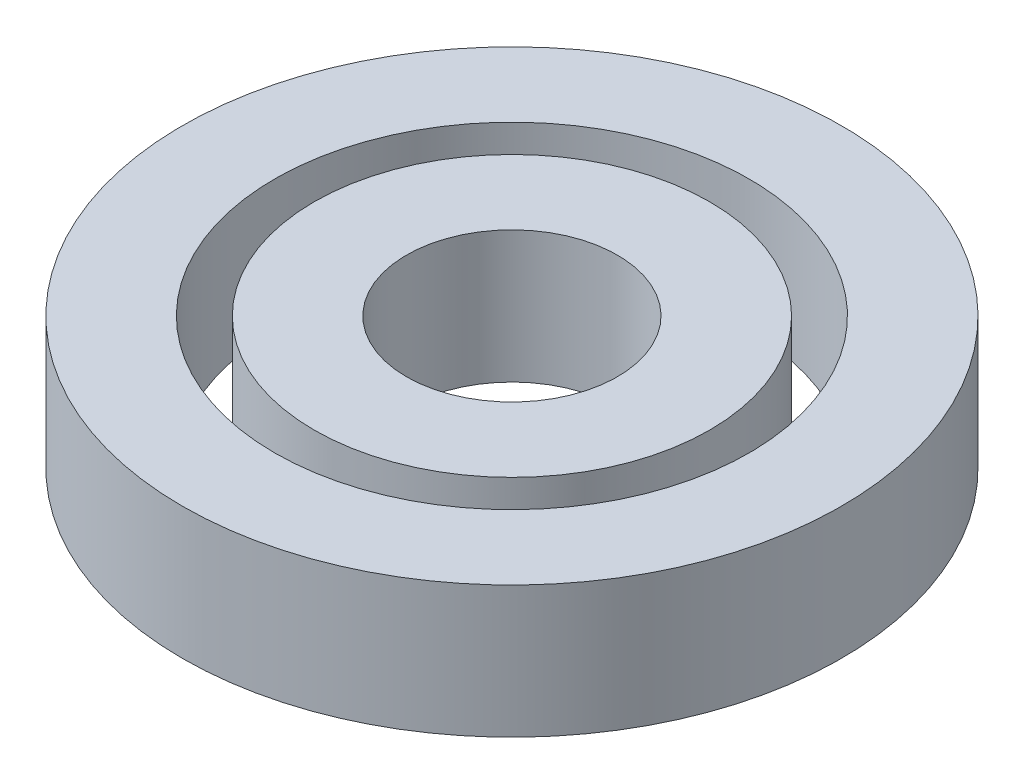
ISO-10303-21;
HEADER;
FILE_DESCRIPTION(('STEP AP214'),'2;1');
FILE_NAME('part.step','',(''),(''),'','','');
FILE_SCHEMA(('AUTOMOTIVE_DESIGN { 1 0 10303 214 1 1 1 1 }'));
ENDSEC;
DATA;
#1=APPLICATION_CONTEXT('core data for automotive mechanical design processes');
#2=APPLICATION_PROTOCOL_DEFINITION('international standard','automotive_design',2000,#1);
#3=PRODUCT_CONTEXT('',#1,'mechanical');
#4=PRODUCT('Part','Part','',(#3));
#5=PRODUCT_RELATED_PRODUCT_CATEGORY('part','',(#4));
#6=PRODUCT_DEFINITION_FORMATION('','',#4);
#7=PRODUCT_DEFINITION_CONTEXT('part definition',#1,'design');
#8=PRODUCT_DEFINITION('design','',#6,#7);
#9=PRODUCT_DEFINITION_SHAPE('','',#8);
#10=(LENGTH_UNIT() NAMED_UNIT(*) SI_UNIT(.MILLI.,.METRE.));
#11=(NAMED_UNIT(*) PLANE_ANGLE_UNIT() SI_UNIT($,.RADIAN.));
#12=(NAMED_UNIT(*) SI_UNIT($,.STERADIAN.) SOLID_ANGLE_UNIT());
#13=UNCERTAINTY_MEASURE_WITH_UNIT(LENGTH_MEASURE(1.E-05),#10,'distance_accuracy_value','');
#14=(GEOMETRIC_REPRESENTATION_CONTEXT(3) GLOBAL_UNCERTAINTY_ASSIGNED_CONTEXT((#13)) GLOBAL_UNIT_ASSIGNED_CONTEXT((#10,
#11,#12)) REPRESENTATION_CONTEXT('',''));
#15=CARTESIAN_POINT('',(0.,0.,0.));
#16=DIRECTION('',(0.,0.,1.));
#17=DIRECTION('',(1.,0.,0.));
#18=AXIS2_PLACEMENT_3D('',#15,#16,#17);
#19=CARTESIAN_POINT('',(0.,5.,0.));
#20=DIRECTION('',(0.,1.,0.));
#21=DIRECTION('',(0.,0.,1.));
#22=AXIS2_PLACEMENT_3D('',#19,#20,#21);
#23=PLANE('',#22);
#24=CARTESIAN_POINT('',(0.,5.,0.));
#25=DIRECTION('',(0.,1.,0.));
#26=DIRECTION('',(0.,0.,1.));
#27=AXIS2_PLACEMENT_3D('',#24,#25,#26);
#28=CIRCLE('',#27,12.5);
#29=CARTESIAN_POINT('',(0.,5.,12.5));
#30=VERTEX_POINT('',#29);
#31=EDGE_CURVE('E11',#30,#30,#28,.T.);
#32=ORIENTED_EDGE('',*,*,#31,.T.);
#33=EDGE_LOOP('',(#32));
#34=FACE_BOUND('',#33,.T.);
#35=CARTESIAN_POINT('',(0.,5.,0.));
#36=DIRECTION('',(0.,1.,0.));
#37=DIRECTION('',(0.,0.,1.));
#38=AXIS2_PLACEMENT_3D('',#35,#36,#37);
#39=CIRCLE('',#38,9.);
#40=CARTESIAN_POINT('',(0.,5.,9.));
#41=VERTEX_POINT('',#40);
#42=EDGE_CURVE('E53',#41,#41,#39,.T.);
#43=ORIENTED_EDGE('',*,*,#42,.F.);
#44=EDGE_LOOP('',(#43));
#45=FACE_BOUND('',#44,.T.);
#46=ADVANCED_FACE('F42',(#34,#45),#23,.T.);
#47=CARTESIAN_POINT('',(0.,0.,0.));
#48=DIRECTION('',(0.,1.,0.));
#49=DIRECTION('',(0.,0.,1.));
#50=AXIS2_PLACEMENT_3D('',#47,#48,#49);
#51=PLANE('',#50);
#52=CARTESIAN_POINT('',(0.,0.,0.));
#53=DIRECTION('',(0.,1.,0.));
#54=DIRECTION('',(0.,0.,1.));
#55=AXIS2_PLACEMENT_3D('',#52,#53,#54);
#56=CIRCLE('',#55,12.5);
#57=CARTESIAN_POINT('',(0.,0.,12.5));
#58=VERTEX_POINT('',#57);
#59=EDGE_CURVE('E46',#58,#58,#56,.T.);
#60=ORIENTED_EDGE('',*,*,#59,.F.);
#61=EDGE_LOOP('',(#60));
#62=FACE_BOUND('',#61,.T.);
#63=CARTESIAN_POINT('',(0.,0.,0.));
#64=DIRECTION('',(0.,1.,0.));
#65=DIRECTION('',(0.,0.,1.));
#66=AXIS2_PLACEMENT_3D('',#63,#64,#65);
#67=CIRCLE('',#66,9.);
#68=CARTESIAN_POINT('',(0.,0.,9.));
#69=VERTEX_POINT('',#68);
#70=EDGE_CURVE('E55',#69,#69,#67,.T.);
#71=ORIENTED_EDGE('',*,*,#70,.T.);
#72=EDGE_LOOP('',(#71));
#73=FACE_BOUND('',#72,.T.);
#74=ADVANCED_FACE('F65',(#62,#73),#51,.F.);
#75=CARTESIAN_POINT('',(0.,5.,0.));
#76=DIRECTION('',(0.,-1.,0.));
#77=DIRECTION('',(0.,0.,-1.));
#78=AXIS2_PLACEMENT_3D('',#75,#76,#77);
#79=CYLINDRICAL_SURFACE('',#78,12.5);
#80=ORIENTED_EDGE('',*,*,#31,.F.);
#81=EDGE_LOOP('',(#80));
#82=FACE_BOUND('',#81,.T.);
#83=ORIENTED_EDGE('',*,*,#59,.T.);
#84=EDGE_LOOP('',(#83));
#85=FACE_BOUND('',#84,.T.);
#86=ADVANCED_FACE('F44',(#82,#85),#79,.T.);
#87=CARTESIAN_POINT('',(0.,5.,0.));
#88=DIRECTION('',(0.,-1.,0.));
#89=DIRECTION('',(0.,0.,-1.));
#90=AXIS2_PLACEMENT_3D('',#87,#88,#89);
#91=CYLINDRICAL_SURFACE('',#90,9.);
#92=ORIENTED_EDGE('',*,*,#42,.T.);
#93=EDGE_LOOP('',(#92));
#94=FACE_BOUND('',#93,.T.);
#95=ORIENTED_EDGE('',*,*,#70,.F.);
#96=EDGE_LOOP('',(#95));
#97=FACE_BOUND('',#96,.T.);
#98=ADVANCED_FACE('F61',(#94,#97),#91,.F.);
#99=CLOSED_SHELL('',(#46,#74,#86,#98));
#100=MANIFOLD_SOLID_BREP('B2',#99);
#101=CARTESIAN_POINT('',(0.,5.,0.));
#102=DIRECTION('',(0.,1.,0.));
#103=DIRECTION('',(0.,0.,1.));
#104=AXIS2_PLACEMENT_3D('',#101,#102,#103);
#105=PLANE('',#104);
#106=CARTESIAN_POINT('',(0.,5.,0.));
#107=DIRECTION('',(0.,1.,0.));
#108=DIRECTION('',(0.,0.,1.));
#109=AXIS2_PLACEMENT_3D('',#106,#107,#108);
#110=CIRCLE('',#109,7.5);
#111=CARTESIAN_POINT('',(0.,5.,7.5));
#112=VERTEX_POINT('',#111);
#113=EDGE_CURVE('E41',#112,#112,#110,.T.);
#114=ORIENTED_EDGE('',*,*,#113,.T.);
#115=EDGE_LOOP('',(#114));
#116=FACE_BOUND('',#115,.T.);
#117=CARTESIAN_POINT('',(0.,5.,0.));
#118=DIRECTION('',(0.,1.,0.));
#119=DIRECTION('',(0.,0.,1.));
#120=AXIS2_PLACEMENT_3D('',#117,#118,#119);
#121=CIRCLE('',#120,4.);
#122=CARTESIAN_POINT('',(0.,5.,4.));
#123=VERTEX_POINT('',#122);
#124=EDGE_CURVE('E114',#123,#123,#121,.T.);
#125=ORIENTED_EDGE('',*,*,#124,.F.);
#126=EDGE_LOOP('',(#125));
#127=FACE_BOUND('',#126,.T.);
#128=ADVANCED_FACE('F103',(#116,#127),#105,.T.);
#129=CARTESIAN_POINT('',(0.,0.,0.));
#130=DIRECTION('',(0.,1.,0.));
#131=DIRECTION('',(0.,0.,1.));
#132=AXIS2_PLACEMENT_3D('',#129,#130,#131);
#133=PLANE('',#132);
#134=CARTESIAN_POINT('',(0.,0.,0.));
#135=DIRECTION('',(0.,1.,0.));
#136=DIRECTION('',(0.,0.,1.));
#137=AXIS2_PLACEMENT_3D('',#134,#135,#136);
#138=CIRCLE('',#137,7.5);
#139=CARTESIAN_POINT('',(0.,0.,7.5));
#140=VERTEX_POINT('',#139);
#141=EDGE_CURVE('E107',#140,#140,#138,.T.);
#142=ORIENTED_EDGE('',*,*,#141,.F.);
#143=EDGE_LOOP('',(#142));
#144=FACE_BOUND('',#143,.T.);
#145=CARTESIAN_POINT('',(0.,0.,0.));
#146=DIRECTION('',(0.,1.,0.));
#147=DIRECTION('',(0.,0.,1.));
#148=AXIS2_PLACEMENT_3D('',#145,#146,#147);
#149=CIRCLE('',#148,4.);
#150=CARTESIAN_POINT('',(0.,0.,4.));
#151=VERTEX_POINT('',#150);
#152=EDGE_CURVE('E116',#151,#151,#149,.T.);
#153=ORIENTED_EDGE('',*,*,#152,.T.);
#154=EDGE_LOOP('',(#153));
#155=FACE_BOUND('',#154,.T.);
#156=ADVANCED_FACE('F126',(#144,#155),#133,.F.);
#157=CARTESIAN_POINT('',(0.,5.,0.));
#158=DIRECTION('',(0.,-1.,0.));
#159=DIRECTION('',(0.,0.,-1.));
#160=AXIS2_PLACEMENT_3D('',#157,#158,#159);
#161=CYLINDRICAL_SURFACE('',#160,7.5);
#162=ORIENTED_EDGE('',*,*,#113,.F.);
#163=EDGE_LOOP('',(#162));
#164=FACE_BOUND('',#163,.T.);
#165=ORIENTED_EDGE('',*,*,#141,.T.);
#166=EDGE_LOOP('',(#165));
#167=FACE_BOUND('',#166,.T.);
#168=ADVANCED_FACE('F105',(#164,#167),#161,.T.);
#169=CARTESIAN_POINT('',(0.,5.,0.));
#170=DIRECTION('',(0.,-1.,0.));
#171=DIRECTION('',(0.,0.,-1.));
#172=AXIS2_PLACEMENT_3D('',#169,#170,#171);
#173=CYLINDRICAL_SURFACE('',#172,4.);
#174=ORIENTED_EDGE('',*,*,#124,.T.);
#175=EDGE_LOOP('',(#174));
#176=FACE_BOUND('',#175,.T.);
#177=ORIENTED_EDGE('',*,*,#152,.F.);
#178=EDGE_LOOP('',(#177));
#179=FACE_BOUND('',#178,.T.);
#180=ADVANCED_FACE('F122',(#176,#179),#173,.F.);
#181=CLOSED_SHELL('',(#128,#156,#168,#180));
#182=MANIFOLD_SOLID_BREP('B6',#181);
#183=ADVANCED_BREP_SHAPE_REPRESENTATION('',(#18,#100,#182),#14);
#184=SHAPE_DEFINITION_REPRESENTATION(#9,#183);
ENDSEC;
END-ISO-10303-21;
